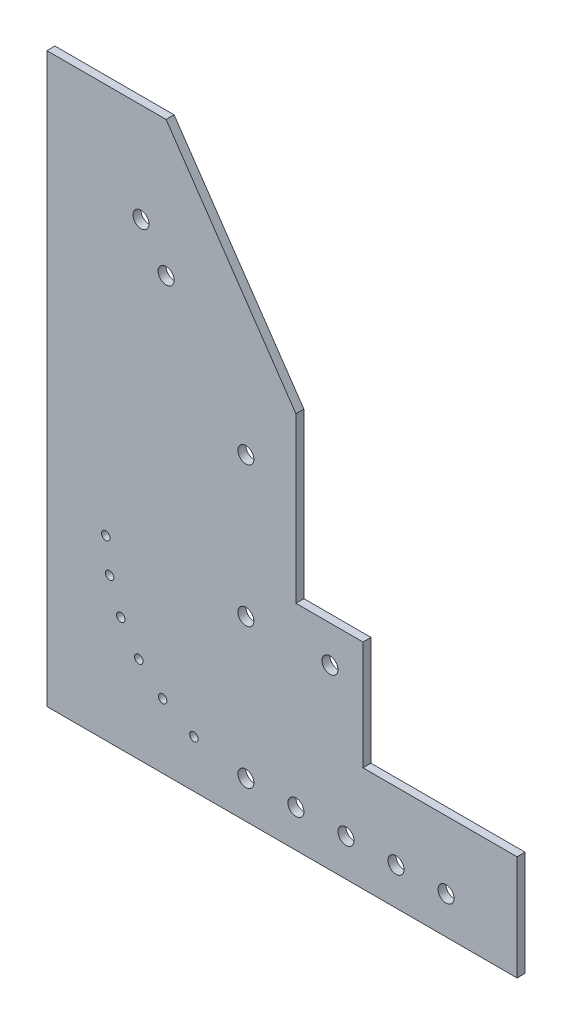
ISO-10303-21;
HEADER;
FILE_DESCRIPTION(('STEP AP214'),'2;1');
FILE_NAME('part.step','',(''),(''),'','','');
FILE_SCHEMA(('AUTOMOTIVE_DESIGN { 1 0 10303 214 1 1 1 1 }'));
ENDSEC;
DATA;
#1=APPLICATION_CONTEXT('core data for automotive mechanical design processes');
#2=APPLICATION_PROTOCOL_DEFINITION('international standard','automotive_design',2000,#1);
#3=PRODUCT_CONTEXT('',#1,'mechanical');
#4=PRODUCT('Part','Part','',(#3));
#5=PRODUCT_RELATED_PRODUCT_CATEGORY('part','',(#4));
#6=PRODUCT_DEFINITION_FORMATION('','',#4);
#7=PRODUCT_DEFINITION_CONTEXT('part definition',#1,'design');
#8=PRODUCT_DEFINITION('design','',#6,#7);
#9=PRODUCT_DEFINITION_SHAPE('','',#8);
#10=(LENGTH_UNIT() NAMED_UNIT(*) SI_UNIT(.MILLI.,.METRE.));
#11=(NAMED_UNIT(*) PLANE_ANGLE_UNIT() SI_UNIT($,.RADIAN.));
#12=(NAMED_UNIT(*) SI_UNIT($,.STERADIAN.) SOLID_ANGLE_UNIT());
#13=UNCERTAINTY_MEASURE_WITH_UNIT(LENGTH_MEASURE(1.E-05),#10,'distance_accuracy_value','');
#14=(GEOMETRIC_REPRESENTATION_CONTEXT(3) GLOBAL_UNCERTAINTY_ASSIGNED_CONTEXT((#13)) GLOBAL_UNIT_ASSIGNED_CONTEXT((#10,
#11,#12)) REPRESENTATION_CONTEXT('',''));
#15=CARTESIAN_POINT('',(0.,0.,0.));
#16=DIRECTION('',(0.,0.,1.));
#17=DIRECTION('',(1.,0.,0.));
#18=AXIS2_PLACEMENT_3D('',#15,#16,#17);
#19=CARTESIAN_POINT('',(123.,-5.,4.));
#20=DIRECTION('',(0.,0.,-1.));
#21=DIRECTION('',(-1.,0.,0.));
#22=AXIS2_PLACEMENT_3D('',#19,#20,#21);
#23=CYLINDRICAL_SURFACE('',#22,3.99999999999999);
#24=CARTESIAN_POINT('',(123.,-5.,0.));
#25=DIRECTION('',(0.,0.,1.));
#26=DIRECTION('',(1.,0.,0.));
#27=AXIS2_PLACEMENT_3D('',#24,#25,#26);
#28=CIRCLE('',#27,3.99999999999999);
#29=CARTESIAN_POINT('',(127.,-5.,0.));
#30=VERTEX_POINT('',#29);
#31=EDGE_CURVE('E267',#30,#30,#28,.T.);
#32=ORIENTED_EDGE('',*,*,#31,.F.);
#33=EDGE_LOOP('',(#32));
#34=FACE_BOUND('',#33,.T.);
#35=CARTESIAN_POINT('',(123.,-5.,4.));
#36=DIRECTION('',(0.,0.,1.));
#37=DIRECTION('',(1.,0.,0.));
#38=AXIS2_PLACEMENT_3D('',#35,#36,#37);
#39=CIRCLE('',#38,3.99999999999999);
#40=CARTESIAN_POINT('',(127.,-5.,4.));
#41=VERTEX_POINT('',#40);
#42=EDGE_CURVE('E171',#41,#41,#39,.T.);
#43=ORIENTED_EDGE('',*,*,#42,.T.);
#44=EDGE_LOOP('',(#43));
#45=FACE_BOUND('',#44,.T.);
#46=ADVANCED_FACE('F41',(#34,#45),#23,.F.);
#47=CARTESIAN_POINT('',(98.,-5.,4.));
#48=DIRECTION('',(0.,0.,-1.));
#49=DIRECTION('',(-1.,0.,0.));
#50=AXIS2_PLACEMENT_3D('',#47,#48,#49);
#51=CYLINDRICAL_SURFACE('',#50,4.00000000000001);
#52=CARTESIAN_POINT('',(98.,-5.,0.));
#53=DIRECTION('',(0.,0.,1.));
#54=DIRECTION('',(1.,0.,0.));
#55=AXIS2_PLACEMENT_3D('',#52,#53,#54);
#56=CIRCLE('',#55,4.00000000000001);
#57=CARTESIAN_POINT('',(102.,-5.,0.));
#58=VERTEX_POINT('',#57);
#59=EDGE_CURVE('E263',#58,#58,#56,.T.);
#60=ORIENTED_EDGE('',*,*,#59,.F.);
#61=EDGE_LOOP('',(#60));
#62=FACE_BOUND('',#61,.T.);
#63=CARTESIAN_POINT('',(98.,-5.,4.));
#64=DIRECTION('',(0.,0.,1.));
#65=DIRECTION('',(1.,0.,0.));
#66=AXIS2_PLACEMENT_3D('',#63,#64,#65);
#67=CIRCLE('',#66,4.00000000000001);
#68=CARTESIAN_POINT('',(102.,-5.,4.));
#69=VERTEX_POINT('',#68);
#70=EDGE_CURVE('E167',#69,#69,#67,.T.);
#71=ORIENTED_EDGE('',*,*,#70,.T.);
#72=EDGE_LOOP('',(#71));
#73=FACE_BOUND('',#72,.T.);
#74=ADVANCED_FACE('F346',(#62,#73),#51,.F.);
#75=CARTESIAN_POINT('',(-51.411814067197,0.,4.));
#76=DIRECTION('',(-1.,0.,0.));
#77=DIRECTION('',(0.,0.,1.));
#78=AXIS2_PLACEMENT_3D('',#75,#76,#77);
#79=PLANE('',#78);
#80=DIRECTION('',(0.,1.,0.));
#81=VECTOR('',#80,1.);
#82=CARTESIAN_POINT('',(-51.411814067197,0.,0.));
#83=LINE('',#82,#81);
#84=CARTESIAN_POINT('',(-51.411814067197,-23.6459619808264,0.));
#85=VERTEX_POINT('',#84);
#86=CARTESIAN_POINT('',(-51.411814067197,260.154233908884,0.));
#87=VERTEX_POINT('',#86);
#88=EDGE_CURVE('E211',#85,#87,#83,.T.);
#89=ORIENTED_EDGE('',*,*,#88,.F.);
#90=DIRECTION('',(0.,0.,-1.));
#91=VECTOR('',#90,1.);
#92=CARTESIAN_POINT('',(-51.411814067197,-23.6459619808264,4.));
#93=LINE('',#92,#91);
#94=CARTESIAN_POINT('',(-51.411814067197,-23.6459619808264,4.));
#95=VERTEX_POINT('',#94);
#96=EDGE_CURVE('E11',#95,#85,#93,.T.);
#97=ORIENTED_EDGE('',*,*,#96,.F.);
#98=DIRECTION('',(0.,1.,0.));
#99=VECTOR('',#98,1.);
#100=CARTESIAN_POINT('',(-51.411814067197,0.,4.));
#101=LINE('',#100,#99);
#102=CARTESIAN_POINT('',(-51.411814067197,260.154233908884,4.));
#103=VERTEX_POINT('',#102);
#104=EDGE_CURVE('E320',#95,#103,#101,.T.);
#105=ORIENTED_EDGE('',*,*,#104,.T.);
#106=DIRECTION('',(0.,0.,-1.));
#107=VECTOR('',#106,1.);
#108=CARTESIAN_POINT('',(-51.411814067197,260.154233908884,4.));
#109=LINE('',#108,#107);
#110=EDGE_CURVE('E59',#103,#87,#109,.T.);
#111=ORIENTED_EDGE('',*,*,#110,.T.);
#112=EDGE_LOOP('',(#89,#97,#105,#111));
#113=FACE_BOUND('',#112,.T.);
#114=ADVANCED_FACE('F352',(#113),#79,.T.);
#115=CARTESIAN_POINT('',(0.,-23.6459619808264,4.));
#116=DIRECTION('',(0.,-1.,0.));
#117=DIRECTION('',(0.,0.,-1.));
#118=AXIS2_PLACEMENT_3D('',#115,#116,#117);
#119=PLANE('',#118);
#120=DIRECTION('',(-1.,0.,0.));
#121=VECTOR('',#120,1.);
#122=CARTESIAN_POINT('',(0.,-23.6459619808264,0.));
#123=LINE('',#122,#121);
#124=CARTESIAN_POINT('',(183.493005705798,-23.6459619808264,0.));
#125=VERTEX_POINT('',#124);
#126=EDGE_CURVE('E214',#125,#85,#123,.T.);
#127=ORIENTED_EDGE('',*,*,#126,.F.);
#128=DIRECTION('',(0.,0.,-1.));
#129=VECTOR('',#128,1.);
#130=CARTESIAN_POINT('',(183.493005705798,-23.6459619808264,4.));
#131=LINE('',#130,#129);
#132=CARTESIAN_POINT('',(183.493005705798,-23.6459619808264,4.));
#133=VERTEX_POINT('',#132);
#134=EDGE_CURVE('E51',#133,#125,#131,.T.);
#135=ORIENTED_EDGE('',*,*,#134,.F.);
#136=DIRECTION('',(-1.,0.,0.));
#137=VECTOR('',#136,1.);
#138=CARTESIAN_POINT('',(0.,-23.6459619808264,4.));
#139=LINE('',#138,#137);
#140=EDGE_CURVE('E313',#133,#95,#139,.T.);
#141=ORIENTED_EDGE('',*,*,#140,.T.);
#142=ORIENTED_EDGE('',*,*,#96,.T.);
#143=EDGE_LOOP('',(#127,#135,#141,#142));
#144=FACE_BOUND('',#143,.T.);
#145=ADVANCED_FACE('F301',(#144),#119,.T.);
#146=CARTESIAN_POINT('',(183.493005705798,0.,4.));
#147=DIRECTION('',(1.,0.,0.));
#148=DIRECTION('',(0.,0.,-1.));
#149=AXIS2_PLACEMENT_3D('',#146,#147,#148);
#150=PLANE('',#149);
#151=DIRECTION('',(0.,-1.,0.));
#152=VECTOR('',#151,1.);
#153=CARTESIAN_POINT('',(183.493005705798,0.,0.));
#154=LINE('',#153,#152);
#155=CARTESIAN_POINT('',(183.493005705798,28.7989864993775,0.));
#156=VERTEX_POINT('',#155);
#157=EDGE_CURVE('E218',#156,#125,#154,.T.);
#158=ORIENTED_EDGE('',*,*,#157,.F.);
#159=DIRECTION('',(0.,0.,-1.));
#160=VECTOR('',#159,1.);
#161=CARTESIAN_POINT('',(183.493005705798,28.7989864993775,4.));
#162=LINE('',#161,#160);
#163=CARTESIAN_POINT('',(183.493005705798,28.7989864993775,4.));
#164=VERTEX_POINT('',#163);
#165=EDGE_CURVE('E288',#164,#156,#162,.T.);
#166=ORIENTED_EDGE('',*,*,#165,.F.);
#167=DIRECTION('',(0.,-1.,0.));
#168=VECTOR('',#167,1.);
#169=CARTESIAN_POINT('',(183.493005705798,0.,4.));
#170=LINE('',#169,#168);
#171=EDGE_CURVE('E297',#164,#133,#170,.T.);
#172=ORIENTED_EDGE('',*,*,#171,.T.);
#173=ORIENTED_EDGE('',*,*,#134,.T.);
#174=EDGE_LOOP('',(#158,#166,#172,#173));
#175=FACE_BOUND('',#174,.T.);
#176=ADVANCED_FACE('F295',(#175),#150,.T.);
#177=CARTESIAN_POINT('',(0.,28.7989864993775,4.));
#178=DIRECTION('',(0.,1.,0.));
#179=DIRECTION('',(0.,0.,1.));
#180=AXIS2_PLACEMENT_3D('',#177,#178,#179);
#181=PLANE('',#180);
#182=DIRECTION('',(1.,0.,0.));
#183=VECTOR('',#182,1.);
#184=CARTESIAN_POINT('',(0.,28.7989864993775,0.));
#185=LINE('',#184,#183);
#186=CARTESIAN_POINT('',(106.485233253853,28.7989864993775,0.));
#187=VERTEX_POINT('',#186);
#188=EDGE_CURVE('E222',#187,#156,#185,.T.);
#189=ORIENTED_EDGE('',*,*,#188,.F.);
#190=DIRECTION('',(0.,0.,-1.));
#191=VECTOR('',#190,1.);
#192=CARTESIAN_POINT('',(106.485233253853,28.7989864993775,4.));
#193=LINE('',#192,#191);
#194=CARTESIAN_POINT('',(106.485233253853,28.7989864993775,4.));
#195=VERTEX_POINT('',#194);
#196=EDGE_CURVE('E285',#195,#187,#193,.T.);
#197=ORIENTED_EDGE('',*,*,#196,.F.);
#198=DIRECTION('',(1.,0.,0.));
#199=VECTOR('',#198,1.);
#200=CARTESIAN_POINT('',(0.,28.7989864993775,4.));
#201=LINE('',#200,#199);
#202=EDGE_CURVE('E311',#195,#164,#201,.T.);
#203=ORIENTED_EDGE('',*,*,#202,.T.);
#204=ORIENTED_EDGE('',*,*,#165,.T.);
#205=EDGE_LOOP('',(#189,#197,#203,#204));
#206=FACE_BOUND('',#205,.T.);
#207=ADVANCED_FACE('F308',(#206),#181,.T.);
#208=CARTESIAN_POINT('',(106.485233253853,0.,4.));
#209=DIRECTION('',(1.,0.,0.));
#210=DIRECTION('',(0.,0.,-1.));
#211=AXIS2_PLACEMENT_3D('',#208,#209,#210);
#212=PLANE('',#211);
#213=DIRECTION('',(0.,-1.,0.));
#214=VECTOR('',#213,1.);
#215=CARTESIAN_POINT('',(106.485233253853,0.,0.));
#216=LINE('',#215,#214);
#217=CARTESIAN_POINT('',(106.485233253853,83.2355153016144,0.));
#218=VERTEX_POINT('',#217);
#219=EDGE_CURVE('E226',#218,#187,#216,.T.);
#220=ORIENTED_EDGE('',*,*,#219,.F.);
#221=DIRECTION('',(0.,0.,-1.));
#222=VECTOR('',#221,1.);
#223=CARTESIAN_POINT('',(106.485233253853,83.2355153016144,4.));
#224=LINE('',#223,#222);
#225=CARTESIAN_POINT('',(106.485233253853,83.2355153016144,4.));
#226=VERTEX_POINT('',#225);
#227=EDGE_CURVE('E282',#226,#218,#224,.T.);
#228=ORIENTED_EDGE('',*,*,#227,.F.);
#229=DIRECTION('',(0.,-1.,0.));
#230=VECTOR('',#229,1.);
#231=CARTESIAN_POINT('',(106.485233253853,0.,4.));
#232=LINE('',#231,#230);
#233=EDGE_CURVE('E318',#226,#195,#232,.T.);
#234=ORIENTED_EDGE('',*,*,#233,.T.);
#235=ORIENTED_EDGE('',*,*,#196,.T.);
#236=EDGE_LOOP('',(#220,#228,#234,#235));
#237=FACE_BOUND('',#236,.T.);
#238=ADVANCED_FACE('F495',(#237),#212,.T.);
#239=CARTESIAN_POINT('',(0.,83.2355153016144,4.));
#240=DIRECTION('',(0.,1.,0.));
#241=DIRECTION('',(0.,0.,1.));
#242=AXIS2_PLACEMENT_3D('',#239,#240,#241);
#243=PLANE('',#242);
#244=DIRECTION('',(1.,0.,0.));
#245=VECTOR('',#244,1.);
#246=CARTESIAN_POINT('',(0.,83.2355153016144,0.));
#247=LINE('',#246,#245);
#248=CARTESIAN_POINT('',(73.,83.2355153016144,0.));
#249=VERTEX_POINT('',#248);
#250=EDGE_CURVE('E230',#249,#218,#247,.T.);
#251=ORIENTED_EDGE('',*,*,#250,.F.);
#252=DIRECTION('',(0.,0.,-1.));
#253=VECTOR('',#252,1.);
#254=CARTESIAN_POINT('',(73.,83.2355153016144,4.));
#255=LINE('',#254,#253);
#256=CARTESIAN_POINT('',(73.,83.2355153016144,4.));
#257=VERTEX_POINT('',#256);
#258=EDGE_CURVE('E125',#257,#249,#255,.T.);
#259=ORIENTED_EDGE('',*,*,#258,.F.);
#260=DIRECTION('',(1.,0.,0.));
#261=VECTOR('',#260,1.);
#262=CARTESIAN_POINT('',(0.,83.2355153016144,4.));
#263=LINE('',#262,#261);
#264=EDGE_CURVE('E136',#257,#226,#263,.T.);
#265=ORIENTED_EDGE('',*,*,#264,.T.);
#266=ORIENTED_EDGE('',*,*,#227,.T.);
#267=EDGE_LOOP('',(#251,#259,#265,#266));
#268=FACE_BOUND('',#267,.T.);
#269=ADVANCED_FACE('F328',(#268),#243,.T.);
#270=CARTESIAN_POINT('',(73.,0.,4.));
#271=DIRECTION('',(1.,0.,0.));
#272=DIRECTION('',(0.,0.,-1.));
#273=AXIS2_PLACEMENT_3D('',#270,#271,#272);
#274=PLANE('',#273);
#275=DIRECTION('',(0.,-1.,0.));
#276=VECTOR('',#275,1.);
#277=CARTESIAN_POINT('',(73.,0.,0.));
#278=LINE('',#277,#276);
#279=CARTESIAN_POINT('',(73.,165.222238558642,0.));
#280=VERTEX_POINT('',#279);
#281=EDGE_CURVE('E120',#280,#249,#278,.T.);
#282=ORIENTED_EDGE('',*,*,#281,.F.);
#283=DIRECTION('',(0.,0.,-1.));
#284=VECTOR('',#283,1.);
#285=CARTESIAN_POINT('',(73.,165.222238558642,4.));
#286=LINE('',#285,#284);
#287=CARTESIAN_POINT('',(73.,165.222238558642,4.));
#288=VERTEX_POINT('',#287);
#289=EDGE_CURVE('E115',#288,#280,#286,.T.);
#290=ORIENTED_EDGE('',*,*,#289,.F.);
#291=DIRECTION('',(0.,-1.,0.));
#292=VECTOR('',#291,1.);
#293=CARTESIAN_POINT('',(73.,0.,4.));
#294=LINE('',#293,#292);
#295=EDGE_CURVE('E118',#288,#257,#294,.T.);
#296=ORIENTED_EDGE('',*,*,#295,.T.);
#297=ORIENTED_EDGE('',*,*,#258,.T.);
#298=EDGE_LOOP('',(#282,#290,#296,#297));
#299=FACE_BOUND('',#298,.T.);
#300=ADVANCED_FACE('F117',(#299),#274,.T.);
#301=CARTESIAN_POINT('',(126.727452635984,86.5928047771272,4.));
#302=DIRECTION('',(0.82565765461547,0.564171460971645,0.));
#303=DIRECTION('',(-0.564171460971645,0.82565765461547,0.));
#304=AXIS2_PLACEMENT_3D('',#301,#302,#303);
#305=PLANE('',#304);
#306=DIRECTION('',(0.564171460971645,-0.82565765461547,0.));
#307=VECTOR('',#306,1.);
#308=CARTESIAN_POINT('',(126.727452635984,86.5928047771272,0.));
#309=LINE('',#308,#307);
#310=CARTESIAN_POINT('',(8.13301522694292,260.154233908884,0.));
#311=VERTEX_POINT('',#310);
#312=EDGE_CURVE('E236',#311,#280,#309,.T.);
#313=ORIENTED_EDGE('',*,*,#312,.F.);
#314=DIRECTION('',(0.,0.,-1.));
#315=VECTOR('',#314,1.);
#316=CARTESIAN_POINT('',(8.13301522694292,260.154233908884,4.));
#317=LINE('',#316,#315);
#318=CARTESIAN_POINT('',(8.13301522694292,260.154233908884,4.));
#319=VERTEX_POINT('',#318);
#320=EDGE_CURVE('E87',#319,#311,#317,.T.);
#321=ORIENTED_EDGE('',*,*,#320,.F.);
#322=DIRECTION('',(0.564171460971645,-0.82565765461547,0.));
#323=VECTOR('',#322,1.);
#324=CARTESIAN_POINT('',(126.727452635984,86.5928047771272,4.));
#325=LINE('',#324,#323);
#326=EDGE_CURVE('E133',#319,#288,#325,.T.);
#327=ORIENTED_EDGE('',*,*,#326,.T.);
#328=ORIENTED_EDGE('',*,*,#289,.T.);
#329=EDGE_LOOP('',(#313,#321,#327,#328));
#330=FACE_BOUND('',#329,.T.);
#331=ADVANCED_FACE('F139',(#330),#305,.T.);
#332=CARTESIAN_POINT('',(22.0192378864668,0.,4.));
#333=DIRECTION('',(0.,0.,-1.));
#334=DIRECTION('',(-1.,0.,0.));
#335=AXIS2_PLACEMENT_3D('',#332,#333,#334);
#336=CYLINDRICAL_SURFACE('',#335,2.1);
#337=CARTESIAN_POINT('',(22.0192378864668,0.,0.));
#338=DIRECTION('',(0.,0.,1.));
#339=DIRECTION('',(1.,0.,0.));
#340=AXIS2_PLACEMENT_3D('',#337,#338,#339);
#341=CIRCLE('',#340,2.1);
#342=CARTESIAN_POINT('',(24.1192378864668,0.,0.));
#343=VERTEX_POINT('',#342);
#344=EDGE_CURVE('E199',#343,#343,#341,.T.);
#345=ORIENTED_EDGE('',*,*,#344,.F.);
#346=EDGE_LOOP('',(#345));
#347=FACE_BOUND('',#346,.T.);
#348=CARTESIAN_POINT('',(22.0192378864668,0.,4.));
#349=DIRECTION('',(0.,0.,1.));
#350=DIRECTION('',(1.,0.,0.));
#351=AXIS2_PLACEMENT_3D('',#348,#349,#350);
#352=CIRCLE('',#351,2.1);
#353=CARTESIAN_POINT('',(24.1192378864668,0.,4.));
#354=VERTEX_POINT('',#353);
#355=EDGE_CURVE('E468',#354,#354,#352,.T.);
#356=ORIENTED_EDGE('',*,*,#355,.T.);
#357=EDGE_LOOP('',(#356));
#358=FACE_BOUND('',#357,.T.);
#359=ADVANCED_FACE('F444',(#347,#358),#336,.F.);
#360=CARTESIAN_POINT('',(48.,-4.99999999999999,4.));
#361=DIRECTION('',(0.,0.,-1.));
#362=DIRECTION('',(-1.,0.,0.));
#363=AXIS2_PLACEMENT_3D('',#360,#361,#362);
#364=CYLINDRICAL_SURFACE('',#363,4.);
#365=CARTESIAN_POINT('',(48.,-4.99999999999999,0.));
#366=DIRECTION('',(0.,0.,1.));
#367=DIRECTION('',(1.,0.,0.));
#368=AXIS2_PLACEMENT_3D('',#365,#366,#367);
#369=CIRCLE('',#368,4.);
#370=CARTESIAN_POINT('',(52.,-4.99999999999999,0.));
#371=VERTEX_POINT('',#370);
#372=EDGE_CURVE('E195',#371,#371,#369,.T.);
#373=ORIENTED_EDGE('',*,*,#372,.F.);
#374=EDGE_LOOP('',(#373));
#375=FACE_BOUND('',#374,.T.);
#376=CARTESIAN_POINT('',(48.,-4.99999999999999,4.));
#377=DIRECTION('',(0.,0.,1.));
#378=DIRECTION('',(1.,0.,0.));
#379=AXIS2_PLACEMENT_3D('',#376,#377,#378);
#380=CIRCLE('',#379,4.);
#381=CARTESIAN_POINT('',(52.,-4.99999999999999,4.));
#382=VERTEX_POINT('',#381);
#383=EDGE_CURVE('E462',#382,#382,#380,.T.);
#384=ORIENTED_EDGE('',*,*,#383,.T.);
#385=EDGE_LOOP('',(#384));
#386=FACE_BOUND('',#385,.T.);
#387=ADVANCED_FACE('F447',(#375,#386),#364,.F.);
#388=CARTESIAN_POINT('',(73.,-5.,4.));
#389=DIRECTION('',(0.,0.,-1.));
#390=DIRECTION('',(-1.,0.,0.));
#391=AXIS2_PLACEMENT_3D('',#388,#389,#390);
#392=CYLINDRICAL_SURFACE('',#391,4.00000000000001);
#393=CARTESIAN_POINT('',(73.,-5.,0.));
#394=DIRECTION('',(0.,0.,1.));
#395=DIRECTION('',(1.,0.,0.));
#396=AXIS2_PLACEMENT_3D('',#393,#394,#395);
#397=CIRCLE('',#396,4.00000000000001);
#398=CARTESIAN_POINT('',(77.,-5.,0.));
#399=VERTEX_POINT('',#398);
#400=EDGE_CURVE('E191',#399,#399,#397,.T.);
#401=ORIENTED_EDGE('',*,*,#400,.F.);
#402=EDGE_LOOP('',(#401));
#403=FACE_BOUND('',#402,.T.);
#404=CARTESIAN_POINT('',(73.,-5.,4.));
#405=DIRECTION('',(0.,0.,1.));
#406=DIRECTION('',(1.,0.,0.));
#407=AXIS2_PLACEMENT_3D('',#404,#405,#406);
#408=CIRCLE('',#407,4.00000000000001);
#409=CARTESIAN_POINT('',(77.,-5.,4.));
#410=VERTEX_POINT('',#409);
#411=EDGE_CURVE('E459',#410,#410,#408,.T.);
#412=ORIENTED_EDGE('',*,*,#411,.T.);
#413=EDGE_LOOP('',(#412));
#414=FACE_BOUND('',#413,.T.);
#415=ADVANCED_FACE('F365',(#403,#414),#392,.F.);
#416=CARTESIAN_POINT('',(48.,135.,4.));
#417=DIRECTION('',(0.,0.,-1.));
#418=DIRECTION('',(-1.,0.,0.));
#419=AXIS2_PLACEMENT_3D('',#416,#417,#418);
#420=CYLINDRICAL_SURFACE('',#419,4.);
#421=CARTESIAN_POINT('',(48.,135.,4.));
#422=DIRECTION('',(0.,0.,1.));
#423=DIRECTION('',(1.,0.,0.));
#424=AXIS2_PLACEMENT_3D('',#421,#422,#423);
#425=CIRCLE('',#424,4.);
#426=CARTESIAN_POINT('',(52.,135.,4.));
#427=VERTEX_POINT('',#426);
#428=EDGE_CURVE('E163',#427,#427,#425,.T.);
#429=ORIENTED_EDGE('',*,*,#428,.T.);
#430=EDGE_LOOP('',(#429));
#431=FACE_BOUND('',#430,.T.);
#432=CARTESIAN_POINT('',(48.,135.,0.));
#433=DIRECTION('',(0.,0.,1.));
#434=DIRECTION('',(1.,0.,0.));
#435=AXIS2_PLACEMENT_3D('',#432,#433,#434);
#436=CIRCLE('',#435,4.);
#437=CARTESIAN_POINT('',(52.,135.,0.));
#438=VERTEX_POINT('',#437);
#439=EDGE_CURVE('E259',#438,#438,#436,.T.);
#440=ORIENTED_EDGE('',*,*,#439,.F.);
#441=EDGE_LOOP('',(#440));
#442=FACE_BOUND('',#441,.T.);
#443=ADVANCED_FACE('F361',(#431,#442),#420,.F.);
#444=CARTESIAN_POINT('',(-4.39660855887501,210.621395196915,4.));
#445=DIRECTION('',(0.,0.,-1.));
#446=DIRECTION('',(-1.,0.,0.));
#447=AXIS2_PLACEMENT_3D('',#444,#445,#446);
#448=CYLINDRICAL_SURFACE('',#447,4.);
#449=CARTESIAN_POINT('',(-4.39660855887501,210.621395196915,4.));
#450=DIRECTION('',(0.,0.,1.));
#451=DIRECTION('',(1.,0.,0.));
#452=AXIS2_PLACEMENT_3D('',#449,#450,#451);
#453=CIRCLE('',#452,4.);
#454=CARTESIAN_POINT('',(-0.396608558875007,210.621395196915,4.));
#455=VERTEX_POINT('',#454);
#456=EDGE_CURVE('E159',#455,#455,#453,.T.);
#457=ORIENTED_EDGE('',*,*,#456,.T.);
#458=EDGE_LOOP('',(#457));
#459=FACE_BOUND('',#458,.T.);
#460=CARTESIAN_POINT('',(-4.39660855887501,210.621395196915,0.));
#461=DIRECTION('',(0.,0.,1.));
#462=DIRECTION('',(1.,0.,0.));
#463=AXIS2_PLACEMENT_3D('',#460,#461,#462);
#464=CIRCLE('',#463,4.);
#465=CARTESIAN_POINT('',(-0.396608558875007,210.621395196915,0.));
#466=VERTEX_POINT('',#465);
#467=EDGE_CURVE('E255',#466,#466,#464,.T.);
#468=ORIENTED_EDGE('',*,*,#467,.F.);
#469=EDGE_LOOP('',(#468));
#470=FACE_BOUND('',#469,.T.);
#471=ADVANCED_FACE('F364',(#459,#470),#448,.F.);
#472=CARTESIAN_POINT('',(90.,65.,4.));
#473=DIRECTION('',(0.,0.,-1.));
#474=DIRECTION('',(-1.,0.,0.));
#475=AXIS2_PLACEMENT_3D('',#472,#473,#474);
#476=CYLINDRICAL_SURFACE('',#475,4.00000000000001);
#477=CARTESIAN_POINT('',(90.,65.,4.));
#478=DIRECTION('',(0.,0.,1.));
#479=DIRECTION('',(1.,0.,0.));
#480=AXIS2_PLACEMENT_3D('',#477,#478,#479);
#481=CIRCLE('',#480,4.00000000000001);
#482=CARTESIAN_POINT('',(94.,65.,4.));
#483=VERTEX_POINT('',#482);
#484=EDGE_CURVE('E155',#483,#483,#481,.T.);
#485=ORIENTED_EDGE('',*,*,#484,.T.);
#486=EDGE_LOOP('',(#485));
#487=FACE_BOUND('',#486,.T.);
#488=CARTESIAN_POINT('',(90.,65.,0.));
#489=DIRECTION('',(0.,0.,1.));
#490=DIRECTION('',(1.,0.,0.));
#491=AXIS2_PLACEMENT_3D('',#488,#489,#490);
#492=CIRCLE('',#491,4.00000000000001);
#493=CARTESIAN_POINT('',(94.,65.,0.));
#494=VERTEX_POINT('',#493);
#495=EDGE_CURVE('E251',#494,#494,#492,.T.);
#496=ORIENTED_EDGE('',*,*,#495,.F.);
#497=EDGE_LOOP('',(#496));
#498=FACE_BOUND('',#497,.T.);
#499=ADVANCED_FACE('F369',(#487,#498),#476,.F.);
#500=CARTESIAN_POINT('',(8.13301522694292,192.538018084609,4.));
#501=DIRECTION('',(0.,0.,-1.));
#502=DIRECTION('',(-1.,0.,0.));
#503=AXIS2_PLACEMENT_3D('',#500,#501,#502);
#504=CYLINDRICAL_SURFACE('',#503,4.);
#505=CARTESIAN_POINT('',(8.13301522694292,192.538018084609,4.));
#506=DIRECTION('',(0.,0.,1.));
#507=DIRECTION('',(1.,0.,0.));
#508=AXIS2_PLACEMENT_3D('',#505,#506,#507);
#509=CIRCLE('',#508,4.);
#510=CARTESIAN_POINT('',(12.1330152269429,192.538018084609,4.));
#511=VERTEX_POINT('',#510);
#512=EDGE_CURVE('E151',#511,#511,#509,.T.);
#513=ORIENTED_EDGE('',*,*,#512,.T.);
#514=EDGE_LOOP('',(#513));
#515=FACE_BOUND('',#514,.T.);
#516=CARTESIAN_POINT('',(8.13301522694292,192.538018084609,0.));
#517=DIRECTION('',(0.,0.,1.));
#518=DIRECTION('',(1.,0.,0.));
#519=AXIS2_PLACEMENT_3D('',#516,#517,#518);
#520=CIRCLE('',#519,4.);
#521=CARTESIAN_POINT('',(12.1330152269429,192.538018084609,0.));
#522=VERTEX_POINT('',#521);
#523=EDGE_CURVE('E247',#522,#522,#520,.T.);
#524=ORIENTED_EDGE('',*,*,#523,.F.);
#525=EDGE_LOOP('',(#524));
#526=FACE_BOUND('',#525,.T.);
#527=ADVANCED_FACE('F341',(#515,#526),#504,.F.);
#528=CARTESIAN_POINT('',(-22.,65.,4.));
#529=DIRECTION('',(0.,0.,-1.));
#530=DIRECTION('',(-1.,0.,0.));
#531=AXIS2_PLACEMENT_3D('',#528,#529,#530);
#532=CYLINDRICAL_SURFACE('',#531,2.1);
#533=CARTESIAN_POINT('',(-22.,65.,4.));
#534=DIRECTION('',(0.,0.,1.));
#535=DIRECTION('',(1.,0.,0.));
#536=AXIS2_PLACEMENT_3D('',#533,#534,#535);
#537=CIRCLE('',#536,2.1);
#538=CARTESIAN_POINT('',(-19.9,65.,4.));
#539=VERTEX_POINT('',#538);
#540=EDGE_CURVE('E144',#539,#539,#537,.T.);
#541=ORIENTED_EDGE('',*,*,#540,.T.);
#542=EDGE_LOOP('',(#541));
#543=FACE_BOUND('',#542,.T.);
#544=CARTESIAN_POINT('',(-22.,65.,0.));
#545=DIRECTION('',(0.,0.,1.));
#546=DIRECTION('',(1.,0.,0.));
#547=AXIS2_PLACEMENT_3D('',#544,#545,#546);
#548=CIRCLE('',#547,2.1);
#549=CARTESIAN_POINT('',(-19.9,65.,0.));
#550=VERTEX_POINT('',#549);
#551=EDGE_CURVE('E243',#550,#550,#548,.T.);
#552=ORIENTED_EDGE('',*,*,#551,.F.);
#553=EDGE_LOOP('',(#552));
#554=FACE_BOUND('',#553,.T.);
#555=ADVANCED_FACE('F332',(#543,#554),#532,.F.);
#556=CARTESIAN_POINT('',(0.,260.154233908884,4.));
#557=DIRECTION('',(0.,1.,0.));
#558=DIRECTION('',(0.,0.,1.));
#559=AXIS2_PLACEMENT_3D('',#556,#557,#558);
#560=PLANE('',#559);
#561=DIRECTION('',(1.,0.,0.));
#562=VECTOR('',#561,1.);
#563=CARTESIAN_POINT('',(0.,260.154233908884,0.));
#564=LINE('',#563,#562);
#565=EDGE_CURVE('E239',#87,#311,#564,.T.);
#566=ORIENTED_EDGE('',*,*,#565,.F.);
#567=ORIENTED_EDGE('',*,*,#110,.F.);
#568=DIRECTION('',(1.,0.,0.));
#569=VECTOR('',#568,1.);
#570=CARTESIAN_POINT('',(0.,260.154233908884,4.));
#571=LINE('',#570,#569);
#572=EDGE_CURVE('E141',#103,#319,#571,.T.);
#573=ORIENTED_EDGE('',*,*,#572,.T.);
#574=ORIENTED_EDGE('',*,*,#320,.T.);
#575=EDGE_LOOP('',(#566,#567,#573,#574));
#576=FACE_BOUND('',#575,.T.);
#577=ADVANCED_FACE('F329',(#576),#560,.T.);
#578=CARTESIAN_POINT('',(-20.09745593164,48.7908514832411,4.));
#579=DIRECTION('',(0.,0.,-1.));
#580=DIRECTION('',(-1.,0.,0.));
#581=AXIS2_PLACEMENT_3D('',#578,#579,#580);
#582=CYLINDRICAL_SURFACE('',#581,2.1);
#583=CARTESIAN_POINT('',(-20.09745593164,48.7908514832411,4.));
#584=DIRECTION('',(0.,0.,1.));
#585=DIRECTION('',(1.,0.,0.));
#586=AXIS2_PLACEMENT_3D('',#583,#584,#585);
#587=CIRCLE('',#586,2.1);
#588=CARTESIAN_POINT('',(-17.99745593164,48.7908514832411,4.));
#589=VERTEX_POINT('',#588);
#590=EDGE_CURVE('E481',#589,#589,#587,.T.);
#591=ORIENTED_EDGE('',*,*,#590,.T.);
#592=EDGE_LOOP('',(#591));
#593=FACE_BOUND('',#592,.T.);
#594=CARTESIAN_POINT('',(-20.09745593164,48.7908514832411,0.));
#595=DIRECTION('',(0.,0.,1.));
#596=DIRECTION('',(1.,0.,0.));
#597=AXIS2_PLACEMENT_3D('',#594,#595,#596);
#598=CIRCLE('',#597,2.1);
#599=CARTESIAN_POINT('',(-17.99745593164,48.7908514832411,0.));
#600=VERTEX_POINT('',#599);
#601=EDGE_CURVE('E207',#600,#600,#598,.T.);
#602=ORIENTED_EDGE('',*,*,#601,.F.);
#603=EDGE_LOOP('',(#602));
#604=FACE_BOUND('',#603,.T.);
#605=ADVANCED_FACE('F331',(#593,#604),#582,.F.);
#606=CARTESIAN_POINT('',(-14.4932429817615,33.4628063768744,4.));
#607=DIRECTION('',(0.,0.,-1.));
#608=DIRECTION('',(-1.,0.,0.));
#609=AXIS2_PLACEMENT_3D('',#606,#607,#608);
#610=CYLINDRICAL_SURFACE('',#609,2.1);
#611=CARTESIAN_POINT('',(-14.4932429817615,33.4628063768744,4.));
#612=DIRECTION('',(0.,0.,1.));
#613=DIRECTION('',(1.,0.,0.));
#614=AXIS2_PLACEMENT_3D('',#611,#612,#613);
#615=CIRCLE('',#614,2.1);
#616=CARTESIAN_POINT('',(-12.3932429817615,33.4628063768744,4.));
#617=VERTEX_POINT('',#616);
#618=EDGE_CURVE('E478',#617,#617,#615,.T.);
#619=ORIENTED_EDGE('',*,*,#618,.T.);
#620=EDGE_LOOP('',(#619));
#621=FACE_BOUND('',#620,.T.);
#622=CARTESIAN_POINT('',(-14.4932429817615,33.4628063768744,0.));
#623=DIRECTION('',(0.,0.,1.));
#624=DIRECTION('',(1.,0.,0.));
#625=AXIS2_PLACEMENT_3D('',#622,#623,#624);
#626=CIRCLE('',#625,2.1);
#627=CARTESIAN_POINT('',(-12.3932429817615,33.4628063768744,0.));
#628=VERTEX_POINT('',#627);
#629=EDGE_CURVE('E203',#628,#628,#626,.T.);
#630=ORIENTED_EDGE('',*,*,#629,.F.);
#631=EDGE_LOOP('',(#630));
#632=FACE_BOUND('',#631,.T.);
#633=ADVANCED_FACE('F338',(#621,#632),#610,.F.);
#634=CARTESIAN_POINT('',(6.41698804635752,8.6896713127758,4.));
#635=DIRECTION('',(0.,0.,-1.));
#636=DIRECTION('',(-1.,0.,0.));
#637=AXIS2_PLACEMENT_3D('',#634,#635,#636);
#638=CYLINDRICAL_SURFACE('',#637,2.09999999999997);
#639=CARTESIAN_POINT('',(6.41698804635752,8.6896713127758,4.));
#640=DIRECTION('',(0.,0.,1.));
#641=DIRECTION('',(1.,0.,0.));
#642=AXIS2_PLACEMENT_3D('',#639,#640,#641);
#643=CIRCLE('',#642,2.09999999999997);
#644=CARTESIAN_POINT('',(8.51698804635749,8.6896713127758,4.));
#645=VERTEX_POINT('',#644);
#646=EDGE_CURVE('E463',#645,#645,#643,.T.);
#647=ORIENTED_EDGE('',*,*,#646,.T.);
#648=EDGE_LOOP('',(#647));
#649=FACE_BOUND('',#648,.T.);
#650=CARTESIAN_POINT('',(6.41698804635752,8.6896713127758,0.));
#651=DIRECTION('',(0.,0.,1.));
#652=DIRECTION('',(1.,0.,0.));
#653=AXIS2_PLACEMENT_3D('',#650,#651,#652);
#654=CIRCLE('',#653,2.09999999999997);
#655=CARTESIAN_POINT('',(8.51698804635749,8.6896713127758,0.));
#656=VERTEX_POINT('',#655);
#657=EDGE_CURVE('E187',#656,#656,#654,.T.);
#658=ORIENTED_EDGE('',*,*,#657,.F.);
#659=EDGE_LOOP('',(#658));
#660=FACE_BOUND('',#659,.T.);
#661=ADVANCED_FACE('F411',(#649,#660),#638,.F.);
#662=CARTESIAN_POINT('',(48.,65.,4.));
#663=DIRECTION('',(0.,0.,-1.));
#664=DIRECTION('',(-1.,0.,0.));
#665=AXIS2_PLACEMENT_3D('',#662,#663,#664);
#666=CYLINDRICAL_SURFACE('',#665,4.);
#667=CARTESIAN_POINT('',(48.,65.,4.));
#668=DIRECTION('',(0.,0.,1.));
#669=DIRECTION('',(1.,0.,0.));
#670=AXIS2_PLACEMENT_3D('',#667,#668,#669);
#671=CIRCLE('',#670,4.);
#672=CARTESIAN_POINT('',(52.,65.,4.));
#673=VERTEX_POINT('',#672);
#674=EDGE_CURVE('E471',#673,#673,#671,.T.);
#675=ORIENTED_EDGE('',*,*,#674,.T.);
#676=EDGE_LOOP('',(#675));
#677=FACE_BOUND('',#676,.T.);
#678=CARTESIAN_POINT('',(48.,65.,0.));
#679=DIRECTION('',(0.,0.,1.));
#680=DIRECTION('',(1.,0.,0.));
#681=AXIS2_PLACEMENT_3D('',#678,#679,#680);
#682=CIRCLE('',#681,4.);
#683=CARTESIAN_POINT('',(52.,65.,0.));
#684=VERTEX_POINT('',#683);
#685=EDGE_CURVE('E183',#684,#684,#682,.T.);
#686=ORIENTED_EDGE('',*,*,#685,.F.);
#687=EDGE_LOOP('',(#686));
#688=FACE_BOUND('',#687,.T.);
#689=ADVANCED_FACE('F404',(#677,#688),#666,.F.);
#690=CARTESIAN_POINT('',(-5.49199721052505,19.8490727179476,4.));
#691=DIRECTION('',(0.,0.,-1.));
#692=DIRECTION('',(-1.,0.,0.));
#693=AXIS2_PLACEMENT_3D('',#690,#691,#692);
#694=CYLINDRICAL_SURFACE('',#693,2.1);
#695=CARTESIAN_POINT('',(-5.49199721052505,19.8490727179476,4.));
#696=DIRECTION('',(0.,0.,1.));
#697=DIRECTION('',(1.,0.,0.));
#698=AXIS2_PLACEMENT_3D('',#695,#696,#697);
#699=CIRCLE('',#698,2.1);
#700=CARTESIAN_POINT('',(-3.39199721052505,19.8490727179476,4.));
#701=VERTEX_POINT('',#700);
#702=EDGE_CURVE('E275',#701,#701,#699,.T.);
#703=ORIENTED_EDGE('',*,*,#702,.T.);
#704=EDGE_LOOP('',(#703));
#705=FACE_BOUND('',#704,.T.);
#706=CARTESIAN_POINT('',(-5.49199721052505,19.8490727179476,0.));
#707=DIRECTION('',(0.,0.,1.));
#708=DIRECTION('',(1.,0.,0.));
#709=AXIS2_PLACEMENT_3D('',#706,#707,#708);
#710=CIRCLE('',#709,2.1);
#711=CARTESIAN_POINT('',(-3.39199721052505,19.8490727179476,0.));
#712=VERTEX_POINT('',#711);
#713=EDGE_CURVE('E179',#712,#712,#710,.T.);
#714=ORIENTED_EDGE('',*,*,#713,.F.);
#715=EDGE_LOOP('',(#714));
#716=FACE_BOUND('',#715,.T.);
#717=ADVANCED_FACE('F43',(#705,#716),#694,.F.);
#718=CARTESIAN_POINT('',(148.,-4.99999999999999,4.));
#719=DIRECTION('',(0.,0.,-1.));
#720=DIRECTION('',(-1.,0.,0.));
#721=AXIS2_PLACEMENT_3D('',#718,#719,#720);
#722=CYLINDRICAL_SURFACE('',#721,3.99999999999999);
#723=CARTESIAN_POINT('',(148.,-4.99999999999999,4.));
#724=DIRECTION('',(0.,0.,1.));
#725=DIRECTION('',(1.,0.,0.));
#726=AXIS2_PLACEMENT_3D('',#723,#724,#725);
#727=CIRCLE('',#726,3.99999999999999);
#728=CARTESIAN_POINT('',(152.,-4.99999999999999,4.));
#729=VERTEX_POINT('',#728);
#730=EDGE_CURVE('E175',#729,#729,#727,.T.);
#731=ORIENTED_EDGE('',*,*,#730,.T.);
#732=EDGE_LOOP('',(#731));
#733=FACE_BOUND('',#732,.T.);
#734=CARTESIAN_POINT('',(148.,-4.99999999999999,0.));
#735=DIRECTION('',(0.,0.,1.));
#736=DIRECTION('',(1.,0.,0.));
#737=AXIS2_PLACEMENT_3D('',#734,#735,#736);
#738=CIRCLE('',#737,3.99999999999999);
#739=CARTESIAN_POINT('',(152.,-4.99999999999999,0.));
#740=VERTEX_POINT('',#739);
#741=EDGE_CURVE('E271',#740,#740,#738,.T.);
#742=ORIENTED_EDGE('',*,*,#741,.F.);
#743=EDGE_LOOP('',(#742));
#744=FACE_BOUND('',#743,.T.);
#745=ADVANCED_FACE('F358',(#733,#744),#722,.F.);
#746=CARTESIAN_POINT('',(0.,0.,4.));
#747=DIRECTION('',(0.,0.,1.));
#748=DIRECTION('',(1.,0.,0.));
#749=AXIS2_PLACEMENT_3D('',#746,#747,#748);
#750=PLANE('',#749);
#751=ORIENTED_EDGE('',*,*,#355,.F.);
#752=EDGE_LOOP('',(#751));
#753=FACE_BOUND('',#752,.T.);
#754=ORIENTED_EDGE('',*,*,#42,.F.);
#755=EDGE_LOOP('',(#754));
#756=FACE_BOUND('',#755,.T.);
#757=ORIENTED_EDGE('',*,*,#70,.F.);
#758=EDGE_LOOP('',(#757));
#759=FACE_BOUND('',#758,.T.);
#760=ORIENTED_EDGE('',*,*,#411,.F.);
#761=EDGE_LOOP('',(#760));
#762=FACE_BOUND('',#761,.T.);
#763=ORIENTED_EDGE('',*,*,#383,.F.);
#764=EDGE_LOOP('',(#763));
#765=FACE_BOUND('',#764,.T.);
#766=ORIENTED_EDGE('',*,*,#702,.F.);
#767=EDGE_LOOP('',(#766));
#768=FACE_BOUND('',#767,.T.);
#769=ORIENTED_EDGE('',*,*,#674,.F.);
#770=EDGE_LOOP('',(#769));
#771=FACE_BOUND('',#770,.T.);
#772=ORIENTED_EDGE('',*,*,#646,.F.);
#773=EDGE_LOOP('',(#772));
#774=FACE_BOUND('',#773,.T.);
#775=ORIENTED_EDGE('',*,*,#618,.F.);
#776=EDGE_LOOP('',(#775));
#777=FACE_BOUND('',#776,.T.);
#778=ORIENTED_EDGE('',*,*,#590,.F.);
#779=EDGE_LOOP('',(#778));
#780=FACE_BOUND('',#779,.T.);
#781=ORIENTED_EDGE('',*,*,#104,.F.);
#782=ORIENTED_EDGE('',*,*,#140,.F.);
#783=ORIENTED_EDGE('',*,*,#171,.F.);
#784=ORIENTED_EDGE('',*,*,#202,.F.);
#785=ORIENTED_EDGE('',*,*,#233,.F.);
#786=ORIENTED_EDGE('',*,*,#264,.F.);
#787=ORIENTED_EDGE('',*,*,#295,.F.);
#788=ORIENTED_EDGE('',*,*,#326,.F.);
#789=ORIENTED_EDGE('',*,*,#572,.F.);
#790=EDGE_LOOP('',(#781,#782,#783,#784,#785,#786,#787,#788,#789));
#791=FACE_BOUND('',#790,.T.);
#792=ORIENTED_EDGE('',*,*,#540,.F.);
#793=EDGE_LOOP('',(#792));
#794=FACE_BOUND('',#793,.T.);
#795=ORIENTED_EDGE('',*,*,#512,.F.);
#796=EDGE_LOOP('',(#795));
#797=FACE_BOUND('',#796,.T.);
#798=ORIENTED_EDGE('',*,*,#484,.F.);
#799=EDGE_LOOP('',(#798));
#800=FACE_BOUND('',#799,.T.);
#801=ORIENTED_EDGE('',*,*,#456,.F.);
#802=EDGE_LOOP('',(#801));
#803=FACE_BOUND('',#802,.T.);
#804=ORIENTED_EDGE('',*,*,#428,.F.);
#805=EDGE_LOOP('',(#804));
#806=FACE_BOUND('',#805,.T.);
#807=ORIENTED_EDGE('',*,*,#730,.F.);
#808=EDGE_LOOP('',(#807));
#809=FACE_BOUND('',#808,.T.);
#810=ADVANCED_FACE('F130',(#753,#756,#759,#762,#765,#768,#771,#774,#777,#780,#791,#794,#797,
#800,#803,#806,#809),#750,.T.);
#811=CARTESIAN_POINT('',(0.,0.,0.));
#812=DIRECTION('',(0.,0.,1.));
#813=DIRECTION('',(1.,0.,0.));
#814=AXIS2_PLACEMENT_3D('',#811,#812,#813);
#815=PLANE('',#814);
#816=ORIENTED_EDGE('',*,*,#713,.T.);
#817=EDGE_LOOP('',(#816));
#818=FACE_BOUND('',#817,.T.);
#819=ORIENTED_EDGE('',*,*,#685,.T.);
#820=EDGE_LOOP('',(#819));
#821=FACE_BOUND('',#820,.T.);
#822=ORIENTED_EDGE('',*,*,#657,.T.);
#823=EDGE_LOOP('',(#822));
#824=FACE_BOUND('',#823,.T.);
#825=ORIENTED_EDGE('',*,*,#400,.T.);
#826=EDGE_LOOP('',(#825));
#827=FACE_BOUND('',#826,.T.);
#828=ORIENTED_EDGE('',*,*,#372,.T.);
#829=EDGE_LOOP('',(#828));
#830=FACE_BOUND('',#829,.T.);
#831=ORIENTED_EDGE('',*,*,#344,.T.);
#832=EDGE_LOOP('',(#831));
#833=FACE_BOUND('',#832,.T.);
#834=ORIENTED_EDGE('',*,*,#629,.T.);
#835=EDGE_LOOP('',(#834));
#836=FACE_BOUND('',#835,.T.);
#837=ORIENTED_EDGE('',*,*,#601,.T.);
#838=EDGE_LOOP('',(#837));
#839=FACE_BOUND('',#838,.T.);
#840=ORIENTED_EDGE('',*,*,#88,.T.);
#841=ORIENTED_EDGE('',*,*,#565,.T.);
#842=ORIENTED_EDGE('',*,*,#312,.T.);
#843=ORIENTED_EDGE('',*,*,#281,.T.);
#844=ORIENTED_EDGE('',*,*,#250,.T.);
#845=ORIENTED_EDGE('',*,*,#219,.T.);
#846=ORIENTED_EDGE('',*,*,#188,.T.);
#847=ORIENTED_EDGE('',*,*,#157,.T.);
#848=ORIENTED_EDGE('',*,*,#126,.T.);
#849=EDGE_LOOP('',(#840,#841,#842,#843,#844,#845,#846,#847,#848));
#850=FACE_BOUND('',#849,.T.);
#851=ORIENTED_EDGE('',*,*,#551,.T.);
#852=EDGE_LOOP('',(#851));
#853=FACE_BOUND('',#852,.T.);
#854=ORIENTED_EDGE('',*,*,#523,.T.);
#855=EDGE_LOOP('',(#854));
#856=FACE_BOUND('',#855,.T.);
#857=ORIENTED_EDGE('',*,*,#495,.T.);
#858=EDGE_LOOP('',(#857));
#859=FACE_BOUND('',#858,.T.);
#860=ORIENTED_EDGE('',*,*,#467,.T.);
#861=EDGE_LOOP('',(#860));
#862=FACE_BOUND('',#861,.T.);
#863=ORIENTED_EDGE('',*,*,#439,.T.);
#864=EDGE_LOOP('',(#863));
#865=FACE_BOUND('',#864,.T.);
#866=ORIENTED_EDGE('',*,*,#59,.T.);
#867=EDGE_LOOP('',(#866));
#868=FACE_BOUND('',#867,.T.);
#869=ORIENTED_EDGE('',*,*,#31,.T.);
#870=EDGE_LOOP('',(#869));
#871=FACE_BOUND('',#870,.T.);
#872=ORIENTED_EDGE('',*,*,#741,.T.);
#873=EDGE_LOOP('',(#872));
#874=FACE_BOUND('',#873,.T.);
#875=ADVANCED_FACE('F303',(#818,#821,#824,#827,#830,#833,#836,#839,#850,#853,#856,#859,#862,
#865,#868,#871,#874),#815,.F.);
#876=CLOSED_SHELL('',(#46,#74,#114,#145,#176,#207,#238,#269,#300,#331,#359,#387,#415,#443,#471,
#499,#527,#555,#577,#605,#633,#661,#689,#717,#745,#810,#875));
#877=MANIFOLD_SOLID_BREP('B2',#876);
#878=ADVANCED_BREP_SHAPE_REPRESENTATION('',(#18,#877),#14);
#879=SHAPE_DEFINITION_REPRESENTATION(#9,#878);
ENDSEC;
END-ISO-10303-21;
